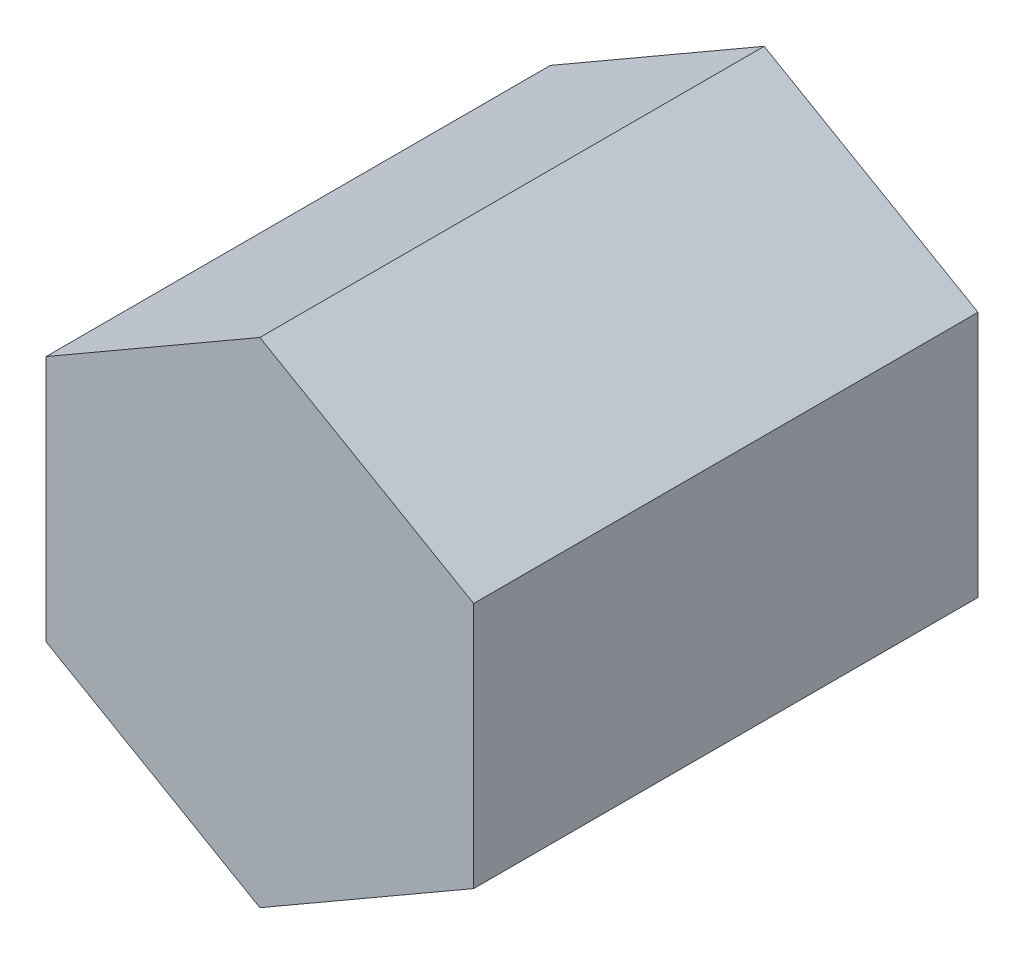
ISO-10303-21;
HEADER;
FILE_DESCRIPTION(('STEP AP214'),'2;1');
FILE_NAME('part.step','',(''),(''),'','','');
FILE_SCHEMA(('AUTOMOTIVE_DESIGN { 1 0 10303 214 1 1 1 1 }'));
ENDSEC;
DATA;
#1=APPLICATION_CONTEXT('core data for automotive mechanical design processes');
#2=APPLICATION_PROTOCOL_DEFINITION('international standard','automotive_design',2000,#1);
#3=PRODUCT_CONTEXT('',#1,'mechanical');
#4=PRODUCT('Part','Part','',(#3));
#5=PRODUCT_RELATED_PRODUCT_CATEGORY('part','',(#4));
#6=PRODUCT_DEFINITION_FORMATION('','',#4);
#7=PRODUCT_DEFINITION_CONTEXT('part definition',#1,'design');
#8=PRODUCT_DEFINITION('design','',#6,#7);
#9=PRODUCT_DEFINITION_SHAPE('','',#8);
#10=(LENGTH_UNIT() NAMED_UNIT(*) SI_UNIT(.MILLI.,.METRE.));
#11=(NAMED_UNIT(*) PLANE_ANGLE_UNIT() SI_UNIT($,.RADIAN.));
#12=(NAMED_UNIT(*) SI_UNIT($,.STERADIAN.) SOLID_ANGLE_UNIT());
#13=UNCERTAINTY_MEASURE_WITH_UNIT(LENGTH_MEASURE(1.E-05),#10,'distance_accuracy_value','');
#14=(GEOMETRIC_REPRESENTATION_CONTEXT(3) GLOBAL_UNCERTAINTY_ASSIGNED_CONTEXT((#13)) GLOBAL_UNIT_ASSIGNED_CONTEXT((#10,
#11,#12)) REPRESENTATION_CONTEXT('',''));
#15=CARTESIAN_POINT('',(0.,0.,0.));
#16=DIRECTION('',(0.,0.,1.));
#17=DIRECTION('',(1.,0.,0.));
#18=AXIS2_PLACEMENT_3D('',#15,#16,#17);
#19=CARTESIAN_POINT('',(21.2,12.2398257068201,25.));
#20=DIRECTION('',(-0.5,-0.866025403784439,0.));
#21=DIRECTION('',(0.866025403784439,-0.5,0.));
#22=AXIS2_PLACEMENT_3D('',#19,#20,#21);
#23=PLANE('',#22);
#24=DIRECTION('',(-0.866025403784439,0.5,0.));
#25=VECTOR('',#24,1.);
#26=CARTESIAN_POINT('',(21.2,12.2398257068201,-25.));
#27=LINE('',#26,#25);
#28=CARTESIAN_POINT('',(21.2,12.2398257068201,-25.));
#29=VERTEX_POINT('',#28);
#30=CARTESIAN_POINT('',(0.,24.4796514136401,-25.));
#31=VERTEX_POINT('',#30);
#32=EDGE_CURVE('E117',#29,#31,#27,.T.);
#33=ORIENTED_EDGE('',*,*,#32,.T.);
#34=DIRECTION('',(0.,0.,-1.));
#35=VECTOR('',#34,1.);
#36=CARTESIAN_POINT('',(0.,24.4796514136401,25.));
#37=LINE('',#36,#35);
#38=CARTESIAN_POINT('',(0.,24.4796514136401,25.));
#39=VERTEX_POINT('',#38);
#40=EDGE_CURVE('E11',#39,#31,#37,.T.);
#41=ORIENTED_EDGE('',*,*,#40,.F.);
#42=DIRECTION('',(-0.866025403784439,0.5,0.));
#43=VECTOR('',#42,1.);
#44=CARTESIAN_POINT('',(21.2,12.2398257068201,25.));
#45=LINE('',#44,#43);
#46=CARTESIAN_POINT('',(21.2,12.2398257068201,25.));
#47=VERTEX_POINT('',#46);
#48=EDGE_CURVE('E127',#47,#39,#45,.T.);
#49=ORIENTED_EDGE('',*,*,#48,.F.);
#50=DIRECTION('',(0.,0.,-1.));
#51=VECTOR('',#50,1.);
#52=CARTESIAN_POINT('',(21.2,12.2398257068201,25.));
#53=LINE('',#52,#51);
#54=EDGE_CURVE('E113',#47,#29,#53,.T.);
#55=ORIENTED_EDGE('',*,*,#54,.T.);
#56=EDGE_LOOP('',(#33,#41,#49,#55));
#57=FACE_BOUND('',#56,.T.);
#58=ADVANCED_FACE('F33',(#57),#23,.F.);
#59=CARTESIAN_POINT('',(0.,24.4796514136401,25.));
#60=DIRECTION('',(0.5,-0.866025403784439,0.));
#61=DIRECTION('',(0.866025403784439,0.5,0.));
#62=AXIS2_PLACEMENT_3D('',#59,#60,#61);
#63=PLANE('',#62);
#64=DIRECTION('',(-0.866025403784439,-0.5,0.));
#65=VECTOR('',#64,1.);
#66=CARTESIAN_POINT('',(0.,24.4796514136401,-25.));
#67=LINE('',#66,#65);
#68=CARTESIAN_POINT('',(-21.2,12.2398257068201,-25.));
#69=VERTEX_POINT('',#68);
#70=EDGE_CURVE('E120',#31,#69,#67,.T.);
#71=ORIENTED_EDGE('',*,*,#70,.T.);
#72=DIRECTION('',(0.,0.,-1.));
#73=VECTOR('',#72,1.);
#74=CARTESIAN_POINT('',(-21.2,12.2398257068201,25.));
#75=LINE('',#74,#73);
#76=CARTESIAN_POINT('',(-21.2,12.2398257068201,25.));
#77=VERTEX_POINT('',#76);
#78=EDGE_CURVE('E41',#77,#69,#75,.T.);
#79=ORIENTED_EDGE('',*,*,#78,.F.);
#80=DIRECTION('',(-0.866025403784439,-0.5,0.));
#81=VECTOR('',#80,1.);
#82=CARTESIAN_POINT('',(0.,24.4796514136401,25.));
#83=LINE('',#82,#81);
#84=EDGE_CURVE('E86',#39,#77,#83,.T.);
#85=ORIENTED_EDGE('',*,*,#84,.F.);
#86=ORIENTED_EDGE('',*,*,#40,.T.);
#87=EDGE_LOOP('',(#71,#79,#85,#86));
#88=FACE_BOUND('',#87,.T.);
#89=ADVANCED_FACE('F151',(#88),#63,.F.);
#90=CARTESIAN_POINT('',(-21.2,12.2398257068201,25.));
#91=DIRECTION('',(1.,0.,0.));
#92=DIRECTION('',(0.,1.,0.));
#93=AXIS2_PLACEMENT_3D('',#90,#91,#92);
#94=PLANE('',#93);
#95=DIRECTION('',(0.,-1.,0.));
#96=VECTOR('',#95,1.);
#97=CARTESIAN_POINT('',(-21.2,12.2398257068201,-25.));
#98=LINE('',#97,#96);
#99=CARTESIAN_POINT('',(-21.2,-12.2398257068201,-25.));
#100=VERTEX_POINT('',#99);
#101=EDGE_CURVE('E122',#69,#100,#98,.T.);
#102=ORIENTED_EDGE('',*,*,#101,.T.);
#103=DIRECTION('',(0.,0.,-1.));
#104=VECTOR('',#103,1.);
#105=CARTESIAN_POINT('',(-21.2,-12.2398257068201,25.));
#106=LINE('',#105,#104);
#107=CARTESIAN_POINT('',(-21.2,-12.2398257068201,25.));
#108=VERTEX_POINT('',#107);
#109=EDGE_CURVE('E108',#108,#100,#106,.T.);
#110=ORIENTED_EDGE('',*,*,#109,.F.);
#111=DIRECTION('',(0.,-1.,0.));
#112=VECTOR('',#111,1.);
#113=CARTESIAN_POINT('',(-21.2,12.2398257068201,25.));
#114=LINE('',#113,#112);
#115=EDGE_CURVE('E99',#77,#108,#114,.T.);
#116=ORIENTED_EDGE('',*,*,#115,.F.);
#117=ORIENTED_EDGE('',*,*,#78,.T.);
#118=EDGE_LOOP('',(#102,#110,#116,#117));
#119=FACE_BOUND('',#118,.T.);
#120=ADVANCED_FACE('F133',(#119),#94,.F.);
#121=CARTESIAN_POINT('',(-21.2,-12.2398257068201,25.));
#122=DIRECTION('',(0.5,0.866025403784438,0.));
#123=DIRECTION('',(-0.866025403784438,0.5,0.));
#124=AXIS2_PLACEMENT_3D('',#121,#122,#123);
#125=PLANE('',#124);
#126=DIRECTION('',(0.866025403784439,-0.5,0.));
#127=VECTOR('',#126,1.);
#128=CARTESIAN_POINT('',(-21.2,-12.2398257068201,-25.));
#129=LINE('',#128,#127);
#130=CARTESIAN_POINT('',(0.,-24.4796514136401,-25.));
#131=VERTEX_POINT('',#130);
#132=EDGE_CURVE('E107',#100,#131,#129,.T.);
#133=ORIENTED_EDGE('',*,*,#132,.T.);
#134=DIRECTION('',(0.,0.,-1.));
#135=VECTOR('',#134,1.);
#136=CARTESIAN_POINT('',(0.,-24.4796514136401,25.));
#137=LINE('',#136,#135);
#138=CARTESIAN_POINT('',(0.,-24.4796514136401,25.));
#139=VERTEX_POINT('',#138);
#140=EDGE_CURVE('E104',#139,#131,#137,.T.);
#141=ORIENTED_EDGE('',*,*,#140,.F.);
#142=DIRECTION('',(0.866025403784439,-0.5,0.));
#143=VECTOR('',#142,1.);
#144=CARTESIAN_POINT('',(-21.2,-12.2398257068201,25.));
#145=LINE('',#144,#143);
#146=EDGE_CURVE('E93',#108,#139,#145,.T.);
#147=ORIENTED_EDGE('',*,*,#146,.F.);
#148=ORIENTED_EDGE('',*,*,#109,.T.);
#149=EDGE_LOOP('',(#133,#141,#147,#148));
#150=FACE_BOUND('',#149,.T.);
#151=ADVANCED_FACE('F105',(#150),#125,.F.);
#152=CARTESIAN_POINT('',(0.,-24.4796514136401,25.));
#153=DIRECTION('',(-0.5,0.866025403784438,0.));
#154=DIRECTION('',(-0.866025403784439,-0.5,0.));
#155=AXIS2_PLACEMENT_3D('',#152,#153,#154);
#156=PLANE('',#155);
#157=DIRECTION('',(0.866025403784438,0.5,0.));
#158=VECTOR('',#157,1.);
#159=CARTESIAN_POINT('',(0.,-24.4796514136401,-25.));
#160=LINE('',#159,#158);
#161=CARTESIAN_POINT('',(21.2,-12.2398257068201,-25.));
#162=VERTEX_POINT('',#161);
#163=EDGE_CURVE('E72',#131,#162,#160,.T.);
#164=ORIENTED_EDGE('',*,*,#163,.T.);
#165=DIRECTION('',(0.,0.,-1.));
#166=VECTOR('',#165,1.);
#167=CARTESIAN_POINT('',(21.2,-12.2398257068201,25.));
#168=LINE('',#167,#166);
#169=CARTESIAN_POINT('',(21.2,-12.2398257068201,25.));
#170=VERTEX_POINT('',#169);
#171=EDGE_CURVE('E109',#170,#162,#168,.T.);
#172=ORIENTED_EDGE('',*,*,#171,.F.);
#173=DIRECTION('',(0.866025403784438,0.5,0.));
#174=VECTOR('',#173,1.);
#175=CARTESIAN_POINT('',(0.,-24.4796514136401,25.));
#176=LINE('',#175,#174);
#177=EDGE_CURVE('E97',#139,#170,#176,.T.);
#178=ORIENTED_EDGE('',*,*,#177,.F.);
#179=ORIENTED_EDGE('',*,*,#140,.T.);
#180=EDGE_LOOP('',(#164,#172,#178,#179));
#181=FACE_BOUND('',#180,.T.);
#182=ADVANCED_FACE('F111',(#181),#156,.F.);
#183=CARTESIAN_POINT('',(21.2,-12.2398257068201,25.));
#184=DIRECTION('',(-1.,0.,0.));
#185=DIRECTION('',(0.,-1.,0.));
#186=AXIS2_PLACEMENT_3D('',#183,#184,#185);
#187=PLANE('',#186);
#188=DIRECTION('',(0.,1.,0.));
#189=VECTOR('',#188,1.);
#190=CARTESIAN_POINT('',(21.2,-12.2398257068201,-25.));
#191=LINE('',#190,#189);
#192=EDGE_CURVE('E78',#162,#29,#191,.T.);
#193=ORIENTED_EDGE('',*,*,#192,.T.);
#194=ORIENTED_EDGE('',*,*,#54,.F.);
#195=DIRECTION('',(0.,1.,0.));
#196=VECTOR('',#195,1.);
#197=CARTESIAN_POINT('',(21.2,-12.2398257068201,25.));
#198=LINE('',#197,#196);
#199=EDGE_CURVE('E49',#170,#47,#198,.T.);
#200=ORIENTED_EDGE('',*,*,#199,.F.);
#201=ORIENTED_EDGE('',*,*,#171,.T.);
#202=EDGE_LOOP('',(#193,#194,#200,#201));
#203=FACE_BOUND('',#202,.T.);
#204=ADVANCED_FACE('F140',(#203),#187,.F.);
#205=CARTESIAN_POINT('',(0.,0.,25.));
#206=DIRECTION('',(0.,0.,1.));
#207=DIRECTION('',(1.,0.,0.));
#208=AXIS2_PLACEMENT_3D('',#205,#206,#207);
#209=PLANE('',#208);
#210=ORIENTED_EDGE('',*,*,#48,.T.);
#211=ORIENTED_EDGE('',*,*,#84,.T.);
#212=ORIENTED_EDGE('',*,*,#115,.T.);
#213=ORIENTED_EDGE('',*,*,#146,.T.);
#214=ORIENTED_EDGE('',*,*,#177,.T.);
#215=ORIENTED_EDGE('',*,*,#199,.T.);
#216=EDGE_LOOP('',(#210,#211,#212,#213,#214,#215));
#217=FACE_BOUND('',#216,.T.);
#218=ADVANCED_FACE('F95',(#217),#209,.T.);
#219=CARTESIAN_POINT('',(0.,0.,-25.));
#220=DIRECTION('',(0.,0.,1.));
#221=DIRECTION('',(1.,0.,0.));
#222=AXIS2_PLACEMENT_3D('',#219,#220,#221);
#223=PLANE('',#222);
#224=ORIENTED_EDGE('',*,*,#32,.F.);
#225=ORIENTED_EDGE('',*,*,#192,.F.);
#226=ORIENTED_EDGE('',*,*,#163,.F.);
#227=ORIENTED_EDGE('',*,*,#132,.F.);
#228=ORIENTED_EDGE('',*,*,#101,.F.);
#229=ORIENTED_EDGE('',*,*,#70,.F.);
#230=EDGE_LOOP('',(#224,#225,#226,#227,#228,#229));
#231=FACE_BOUND('',#230,.T.);
#232=ADVANCED_FACE('F136',(#231),#223,.F.);
#233=CLOSED_SHELL('',(#58,#89,#120,#151,#182,#204,#218,#232));
#234=MANIFOLD_SOLID_BREP('B2',#233);
#235=ADVANCED_BREP_SHAPE_REPRESENTATION('',(#18,#234),#14);
#236=SHAPE_DEFINITION_REPRESENTATION(#9,#235);
ENDSEC;
END-ISO-10303-21;
